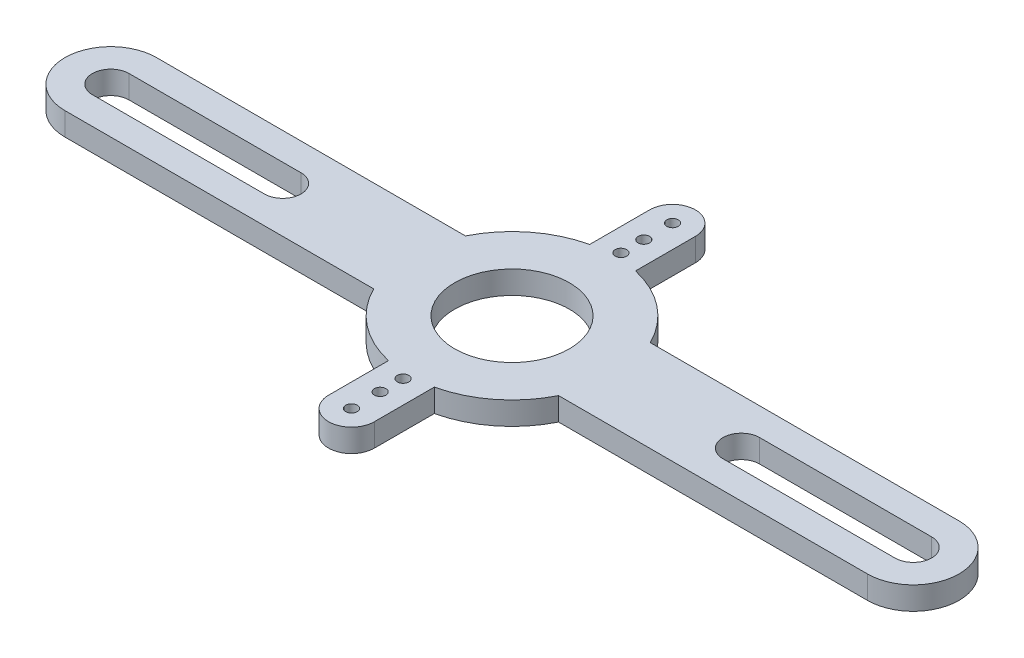
ISO-10303-21;
HEADER;
FILE_DESCRIPTION(('STEP AP214'),'2;1');
FILE_NAME('part.step','',(''),(''),'','','');
FILE_SCHEMA(('AUTOMOTIVE_DESIGN { 1 0 10303 214 1 1 1 1 }'));
ENDSEC;
DATA;
#1=APPLICATION_CONTEXT('core data for automotive mechanical design processes');
#2=APPLICATION_PROTOCOL_DEFINITION('international standard','automotive_design',2000,#1);
#3=PRODUCT_CONTEXT('',#1,'mechanical');
#4=PRODUCT('Part','Part','',(#3));
#5=PRODUCT_RELATED_PRODUCT_CATEGORY('part','',(#4));
#6=PRODUCT_DEFINITION_FORMATION('','',#4);
#7=PRODUCT_DEFINITION_CONTEXT('part definition',#1,'design');
#8=PRODUCT_DEFINITION('design','',#6,#7);
#9=PRODUCT_DEFINITION_SHAPE('','',#8);
#10=(LENGTH_UNIT() NAMED_UNIT(*) SI_UNIT(.MILLI.,.METRE.));
#11=(NAMED_UNIT(*) PLANE_ANGLE_UNIT() SI_UNIT($,.RADIAN.));
#12=(NAMED_UNIT(*) SI_UNIT($,.STERADIAN.) SOLID_ANGLE_UNIT());
#13=UNCERTAINTY_MEASURE_WITH_UNIT(LENGTH_MEASURE(1.E-05),#10,'distance_accuracy_value','');
#14=(GEOMETRIC_REPRESENTATION_CONTEXT(3) GLOBAL_UNCERTAINTY_ASSIGNED_CONTEXT((#13)) GLOBAL_UNIT_ASSIGNED_CONTEXT((#10,
#11,#12)) REPRESENTATION_CONTEXT('',''));
#15=CARTESIAN_POINT('',(0.,0.,0.));
#16=DIRECTION('',(0.,0.,1.));
#17=DIRECTION('',(1.,0.,0.));
#18=AXIS2_PLACEMENT_3D('',#15,#16,#17);
#19=CARTESIAN_POINT('',(33.,-82.4621125123532,0.));
#20=DIRECTION('',(-1.,0.,0.));
#21=DIRECTION('',(0.,0.,1.));
#22=AXIS2_PLACEMENT_3D('',#19,#20,#21);
#23=PLANE('',#22);
#24=DIRECTION('',(0.,1.,0.));
#25=VECTOR('',#24,1.);
#26=CARTESIAN_POINT('',(33.,-25.4558441227157,-8.77496438739212));
#27=LINE('',#26,#25);
#28=CARTESIAN_POINT('',(33.,2.,-8.77496438739212));
#29=VERTEX_POINT('',#28);
#30=CARTESIAN_POINT('',(33.,0.,-8.77496438739212));
#31=VERTEX_POINT('',#30);
#32=EDGE_CURVE('E758',#29,#31,#27,.F.);
#33=ORIENTED_EDGE('',*,*,#32,.F.);
#34=DIRECTION('',(0.,0.,1.));
#35=VECTOR('',#34,1.);
#36=CARTESIAN_POINT('',(33.,2.,0.));
#37=LINE('',#36,#35);
#38=CARTESIAN_POINT('',(33.,2.,-14.));
#39=VERTEX_POINT('',#38);
#40=EDGE_CURVE('E258',#39,#29,#37,.T.);
#41=ORIENTED_EDGE('',*,*,#40,.F.);
#42=DIRECTION('',(0.,1.,0.));
#43=VECTOR('',#42,1.);
#44=CARTESIAN_POINT('',(33.,-82.4621125123532,-14.));
#45=LINE('',#44,#43);
#46=CARTESIAN_POINT('',(33.,0.,-14.));
#47=VERTEX_POINT('',#46);
#48=EDGE_CURVE('E317',#47,#39,#45,.T.);
#49=ORIENTED_EDGE('',*,*,#48,.F.);
#50=DIRECTION('',(0.,0.,-1.));
#51=VECTOR('',#50,1.);
#52=CARTESIAN_POINT('',(33.,0.,0.));
#53=LINE('',#52,#51);
#54=EDGE_CURVE('E348',#31,#47,#53,.T.);
#55=ORIENTED_EDGE('',*,*,#54,.F.);
#56=EDGE_LOOP('',(#33,#41,#49,#55));
#57=FACE_BOUND('',#56,.T.);
#58=ADVANCED_FACE('F40',(#57),#23,.T.);
#59=CARTESIAN_POINT('',(37.,-82.4621125123532,0.));
#60=DIRECTION('',(-1.,0.,0.));
#61=DIRECTION('',(0.,0.,1.));
#62=AXIS2_PLACEMENT_3D('',#59,#60,#61);
#63=PLANE('',#62);
#64=DIRECTION('',(0.,0.,1.));
#65=VECTOR('',#64,1.);
#66=CARTESIAN_POINT('',(37.,2.,0.));
#67=LINE('',#66,#65);
#68=CARTESIAN_POINT('',(37.,2.,-14.));
#69=VERTEX_POINT('',#68);
#70=CARTESIAN_POINT('',(37.,2.,-8.77496438739212));
#71=VERTEX_POINT('',#70);
#72=EDGE_CURVE('E55',#69,#71,#67,.T.);
#73=ORIENTED_EDGE('',*,*,#72,.T.);
#74=DIRECTION('',(0.,1.,0.));
#75=VECTOR('',#74,1.);
#76=CARTESIAN_POINT('',(37.,-25.4558441227157,-8.77496438739212));
#77=LINE('',#76,#75);
#78=CARTESIAN_POINT('',(37.,0.,-8.77496438739212));
#79=VERTEX_POINT('',#78);
#80=EDGE_CURVE('E765',#71,#79,#77,.F.);
#81=ORIENTED_EDGE('',*,*,#80,.T.);
#82=DIRECTION('',(0.,0.,-1.));
#83=VECTOR('',#82,1.);
#84=CARTESIAN_POINT('',(37.,0.,0.));
#85=LINE('',#84,#83);
#86=CARTESIAN_POINT('',(37.,0.,-14.));
#87=VERTEX_POINT('',#86);
#88=EDGE_CURVE('E301',#79,#87,#85,.T.);
#89=ORIENTED_EDGE('',*,*,#88,.T.);
#90=DIRECTION('',(0.,1.,0.));
#91=VECTOR('',#90,1.);
#92=CARTESIAN_POINT('',(37.,-82.4621125123532,-14.));
#93=LINE('',#92,#91);
#94=EDGE_CURVE('E322',#87,#69,#93,.T.);
#95=ORIENTED_EDGE('',*,*,#94,.T.);
#96=EDGE_LOOP('',(#73,#81,#89,#95));
#97=FACE_BOUND('',#96,.T.);
#98=ADVANCED_FACE('F441',(#97),#63,.F.);
#99=CARTESIAN_POINT('',(37.,-82.4621125123532,0.));
#100=DIRECTION('',(1.,0.,0.));
#101=DIRECTION('',(0.,0.,-1.));
#102=AXIS2_PLACEMENT_3D('',#99,#100,#101);
#103=PLANE('',#102);
#104=DIRECTION('',(0.,1.,0.));
#105=VECTOR('',#104,1.);
#106=CARTESIAN_POINT('',(37.,-25.4558441227157,8.77496438739212));
#107=LINE('',#106,#105);
#108=CARTESIAN_POINT('',(37.,2.,8.77496438739212));
#109=VERTEX_POINT('',#108);
#110=CARTESIAN_POINT('',(37.,0.,8.77496438739212));
#111=VERTEX_POINT('',#110);
#112=EDGE_CURVE('E217',#109,#111,#107,.F.);
#113=ORIENTED_EDGE('',*,*,#112,.F.);
#114=DIRECTION('',(0.,0.,-1.));
#115=VECTOR('',#114,1.);
#116=CARTESIAN_POINT('',(37.,2.,0.));
#117=LINE('',#116,#115);
#118=CARTESIAN_POINT('',(37.,2.,14.));
#119=VERTEX_POINT('',#118);
#120=EDGE_CURVE('E311',#119,#109,#117,.T.);
#121=ORIENTED_EDGE('',*,*,#120,.F.);
#122=DIRECTION('',(0.,1.,0.));
#123=VECTOR('',#122,1.);
#124=CARTESIAN_POINT('',(37.,-82.4621125123532,14.));
#125=LINE('',#124,#123);
#126=CARTESIAN_POINT('',(37.,0.,14.));
#127=VERTEX_POINT('',#126);
#128=EDGE_CURVE('E315',#127,#119,#125,.T.);
#129=ORIENTED_EDGE('',*,*,#128,.F.);
#130=DIRECTION('',(0.,0.,1.));
#131=VECTOR('',#130,1.);
#132=CARTESIAN_POINT('',(37.,0.,0.));
#133=LINE('',#132,#131);
#134=EDGE_CURVE('E346',#111,#127,#133,.T.);
#135=ORIENTED_EDGE('',*,*,#134,.F.);
#136=EDGE_LOOP('',(#113,#121,#129,#135));
#137=FACE_BOUND('',#136,.T.);
#138=ADVANCED_FACE('F447',(#137),#103,.T.);
#139=CARTESIAN_POINT('',(33.,-82.4621125123532,0.));
#140=DIRECTION('',(1.,0.,0.));
#141=DIRECTION('',(0.,0.,-1.));
#142=AXIS2_PLACEMENT_3D('',#139,#140,#141);
#143=PLANE('',#142);
#144=DIRECTION('',(0.,0.,-1.));
#145=VECTOR('',#144,1.);
#146=CARTESIAN_POINT('',(33.,2.,0.));
#147=LINE('',#146,#145);
#148=CARTESIAN_POINT('',(33.,2.,14.));
#149=VERTEX_POINT('',#148);
#150=CARTESIAN_POINT('',(33.,2.,8.77496438739212));
#151=VERTEX_POINT('',#150);
#152=EDGE_CURVE('E63',#149,#151,#147,.T.);
#153=ORIENTED_EDGE('',*,*,#152,.T.);
#154=DIRECTION('',(0.,1.,0.));
#155=VECTOR('',#154,1.);
#156=CARTESIAN_POINT('',(33.,-25.4558441227157,8.77496438739212));
#157=LINE('',#156,#155);
#158=CARTESIAN_POINT('',(33.,0.,8.77496438739212));
#159=VERTEX_POINT('',#158);
#160=EDGE_CURVE('E212',#151,#159,#157,.F.);
#161=ORIENTED_EDGE('',*,*,#160,.T.);
#162=DIRECTION('',(0.,0.,1.));
#163=VECTOR('',#162,1.);
#164=CARTESIAN_POINT('',(33.,0.,0.));
#165=LINE('',#164,#163);
#166=CARTESIAN_POINT('',(33.,0.,14.));
#167=VERTEX_POINT('',#166);
#168=EDGE_CURVE('E202',#159,#167,#165,.T.);
#169=ORIENTED_EDGE('',*,*,#168,.T.);
#170=DIRECTION('',(0.,1.,0.));
#171=VECTOR('',#170,1.);
#172=CARTESIAN_POINT('',(33.,-82.4621125123532,14.));
#173=LINE('',#172,#171);
#174=EDGE_CURVE('E209',#167,#149,#173,.T.);
#175=ORIENTED_EDGE('',*,*,#174,.T.);
#176=EDGE_LOOP('',(#153,#161,#169,#175));
#177=FACE_BOUND('',#176,.T.);
#178=ADVANCED_FACE('F213',(#177),#143,.F.);
#179=CARTESIAN_POINT('',(0.,2.,0.));
#180=DIRECTION('',(0.,1.,0.));
#181=DIRECTION('',(0.,0.,1.));
#182=AXIS2_PLACEMENT_3D('',#179,#180,#181);
#183=PLANE('',#182);
#184=CARTESIAN_POINT('',(35.,2.,0.));
#185=DIRECTION('',(0.,1.,0.));
#186=DIRECTION('',(0.,0.,1.));
#187=AXIS2_PLACEMENT_3D('',#184,#185,#186);
#188=CIRCLE('',#187,5.);
#189=CARTESIAN_POINT('',(35.,2.,5.));
#190=VERTEX_POINT('',#189);
#191=EDGE_CURVE('E244',#190,#190,#188,.T.);
#192=ORIENTED_EDGE('',*,*,#191,.F.);
#193=EDGE_LOOP('',(#192));
#194=FACE_BOUND('',#193,.T.);
#195=ORIENTED_EDGE('',*,*,#40,.T.);
#196=CARTESIAN_POINT('',(35.,2.,0.));
#197=DIRECTION('',(0.,1.,0.));
#198=DIRECTION('',(0.,0.,1.));
#199=AXIS2_PLACEMENT_3D('',#196,#197,#198);
#200=CIRCLE('',#199,9.);
#201=CARTESIAN_POINT('',(26.9377422517015,2.,-4.));
#202=VERTEX_POINT('',#201);
#203=EDGE_CURVE('E243',#29,#202,#200,.T.);
#204=ORIENTED_EDGE('',*,*,#203,.T.);
#205=DIRECTION('',(1.,0.,0.));
#206=VECTOR('',#205,1.);
#207=CARTESIAN_POINT('',(0.,2.,-4.));
#208=LINE('',#207,#206);
#209=CARTESIAN_POINT('',(0.,2.,-4.));
#210=VERTEX_POINT('',#209);
#211=EDGE_CURVE('E776',#210,#202,#208,.T.);
#212=ORIENTED_EDGE('',*,*,#211,.F.);
#213=CARTESIAN_POINT('',(0.,2.,0.));
#214=DIRECTION('',(0.,1.,0.));
#215=DIRECTION('',(0.,0.,1.));
#216=AXIS2_PLACEMENT_3D('',#213,#214,#215);
#217=CIRCLE('',#216,4.);
#218=CARTESIAN_POINT('',(0.,2.,4.));
#219=VERTEX_POINT('',#218);
#220=EDGE_CURVE('E771',#210,#219,#217,.T.);
#221=ORIENTED_EDGE('',*,*,#220,.T.);
#222=DIRECTION('',(-1.,0.,0.));
#223=VECTOR('',#222,1.);
#224=CARTESIAN_POINT('',(0.,2.,4.));
#225=LINE('',#224,#223);
#226=CARTESIAN_POINT('',(26.9377422517015,2.,4.));
#227=VERTEX_POINT('',#226);
#228=EDGE_CURVE('E786',#227,#219,#225,.T.);
#229=ORIENTED_EDGE('',*,*,#228,.F.);
#230=EDGE_CURVE('E238',#227,#151,#200,.T.);
#231=ORIENTED_EDGE('',*,*,#230,.T.);
#232=ORIENTED_EDGE('',*,*,#152,.F.);
#233=CARTESIAN_POINT('',(35.,2.,14.));
#234=DIRECTION('',(0.,1.,0.));
#235=DIRECTION('',(0.,0.,1.));
#236=AXIS2_PLACEMENT_3D('',#233,#234,#235);
#237=CIRCLE('',#236,2.);
#238=EDGE_CURVE('E210',#119,#149,#237,.F.);
#239=ORIENTED_EDGE('',*,*,#238,.F.);
#240=ORIENTED_EDGE('',*,*,#120,.T.);
#241=CARTESIAN_POINT('',(43.0622577482986,2.,4.));
#242=VERTEX_POINT('',#241);
#243=EDGE_CURVE('E231',#109,#242,#200,.T.);
#244=ORIENTED_EDGE('',*,*,#243,.T.);
#245=CARTESIAN_POINT('',(70.,2.,4.00000000000001));
#246=VERTEX_POINT('',#245);
#247=EDGE_CURVE('E783',#246,#242,#225,.T.);
#248=ORIENTED_EDGE('',*,*,#247,.F.);
#249=CARTESIAN_POINT('',(70.,2.,0.));
#250=DIRECTION('',(0.,1.,0.));
#251=DIRECTION('',(0.,0.,1.));
#252=AXIS2_PLACEMENT_3D('',#249,#250,#251);
#253=CIRCLE('',#252,4.00000000000001);
#254=CARTESIAN_POINT('',(70.,2.,-4.00000000000001));
#255=VERTEX_POINT('',#254);
#256=EDGE_CURVE('E775',#246,#255,#253,.T.);
#257=ORIENTED_EDGE('',*,*,#256,.T.);
#258=DIRECTION('',(1.,0.,0.));
#259=VECTOR('',#258,1.);
#260=CARTESIAN_POINT('',(0.,2.,-4.));
#261=LINE('',#260,#259);
#262=CARTESIAN_POINT('',(43.0622577482986,2.,-4.));
#263=VERTEX_POINT('',#262);
#264=EDGE_CURVE('E762',#263,#255,#261,.T.);
#265=ORIENTED_EDGE('',*,*,#264,.F.);
#266=EDGE_CURVE('E236',#263,#71,#200,.T.);
#267=ORIENTED_EDGE('',*,*,#266,.T.);
#268=ORIENTED_EDGE('',*,*,#72,.F.);
#269=CARTESIAN_POINT('',(35.,2.,-14.));
#270=DIRECTION('',(0.,1.,0.));
#271=DIRECTION('',(0.,0.,1.));
#272=AXIS2_PLACEMENT_3D('',#269,#270,#271);
#273=CIRCLE('',#272,2.);
#274=EDGE_CURVE('E319',#69,#39,#273,.T.);
#275=ORIENTED_EDGE('',*,*,#274,.T.);
#276=EDGE_LOOP('',(#195,#204,#212,#221,#229,#231,#232,#239,#240,#244,#248,#257,#265,#267,#268,#275));
#277=FACE_BOUND('',#276,.T.);
#278=CARTESIAN_POINT('',(35.,2.,-9.5));
#279=DIRECTION('',(0.,1.,0.));
#280=DIRECTION('',(0.,0.,1.));
#281=AXIS2_PLACEMENT_3D('',#278,#279,#280);
#282=CIRCLE('',#281,0.499999999999999);
#283=CARTESIAN_POINT('',(35.,2.,-9.));
#284=VERTEX_POINT('',#283);
#285=EDGE_CURVE('E262',#284,#284,#282,.T.);
#286=ORIENTED_EDGE('',*,*,#285,.F.);
#287=EDGE_LOOP('',(#286));
#288=FACE_BOUND('',#287,.T.);
#289=CARTESIAN_POINT('',(35.,2.,9.5));
#290=DIRECTION('',(0.,1.,0.));
#291=DIRECTION('',(0.,0.,1.));
#292=AXIS2_PLACEMENT_3D('',#289,#290,#291);
#293=CIRCLE('',#292,0.499999999999999);
#294=CARTESIAN_POINT('',(35.,2.,10.));
#295=VERTEX_POINT('',#294);
#296=EDGE_CURVE('E266',#295,#295,#293,.F.);
#297=ORIENTED_EDGE('',*,*,#296,.T.);
#298=EDGE_LOOP('',(#297));
#299=FACE_BOUND('',#298,.T.);
#300=CARTESIAN_POINT('',(35.,2.,11.5));
#301=DIRECTION('',(0.,1.,0.));
#302=DIRECTION('',(0.,0.,1.));
#303=AXIS2_PLACEMENT_3D('',#300,#301,#302);
#304=CIRCLE('',#303,0.499999999999999);
#305=CARTESIAN_POINT('',(35.,2.,12.));
#306=VERTEX_POINT('',#305);
#307=EDGE_CURVE('E270',#306,#306,#304,.F.);
#308=ORIENTED_EDGE('',*,*,#307,.T.);
#309=EDGE_LOOP('',(#308));
#310=FACE_BOUND('',#309,.T.);
#311=CARTESIAN_POINT('',(35.,2.,14.));
#312=DIRECTION('',(0.,1.,0.));
#313=DIRECTION('',(0.,0.,1.));
#314=AXIS2_PLACEMENT_3D('',#311,#312,#313);
#315=CIRCLE('',#314,0.499999999999999);
#316=CARTESIAN_POINT('',(35.,2.,14.5));
#317=VERTEX_POINT('',#316);
#318=EDGE_CURVE('E274',#317,#317,#315,.F.);
#319=ORIENTED_EDGE('',*,*,#318,.T.);
#320=EDGE_LOOP('',(#319));
#321=FACE_BOUND('',#320,.T.);
#322=DIRECTION('',(1.,0.,0.));
#323=VECTOR('',#322,1.);
#324=CARTESIAN_POINT('',(0.,2.,-1.6));
#325=LINE('',#324,#323);
#326=CARTESIAN_POINT('',(0.,2.,-1.6));
#327=VERTEX_POINT('',#326);
#328=CARTESIAN_POINT('',(15.,2.,-1.6));
#329=VERTEX_POINT('',#328);
#330=EDGE_CURVE('E279',#327,#329,#325,.T.);
#331=ORIENTED_EDGE('',*,*,#330,.T.);
#332=CARTESIAN_POINT('',(15.,2.,0.));
#333=DIRECTION('',(0.,1.,0.));
#334=DIRECTION('',(0.,0.,1.));
#335=AXIS2_PLACEMENT_3D('',#332,#333,#334);
#336=CIRCLE('',#335,1.6);
#337=CARTESIAN_POINT('',(15.,2.,1.6));
#338=VERTEX_POINT('',#337);
#339=EDGE_CURVE('E413',#329,#338,#336,.F.);
#340=ORIENTED_EDGE('',*,*,#339,.T.);
#341=DIRECTION('',(-1.,0.,0.));
#342=VECTOR('',#341,1.);
#343=CARTESIAN_POINT('',(0.,2.,1.6));
#344=LINE('',#343,#342);
#345=CARTESIAN_POINT('',(0.,2.,1.6));
#346=VERTEX_POINT('',#345);
#347=EDGE_CURVE('E396',#338,#346,#344,.T.);
#348=ORIENTED_EDGE('',*,*,#347,.T.);
#349=CARTESIAN_POINT('',(0.,2.,0.));
#350=DIRECTION('',(0.,1.,0.));
#351=DIRECTION('',(0.,0.,1.));
#352=AXIS2_PLACEMENT_3D('',#349,#350,#351);
#353=CIRCLE('',#352,1.6);
#354=EDGE_CURVE('E410',#346,#327,#353,.F.);
#355=ORIENTED_EDGE('',*,*,#354,.T.);
#356=EDGE_LOOP('',(#331,#340,#348,#355));
#357=FACE_BOUND('',#356,.T.);
#358=CARTESIAN_POINT('',(35.,2.,-11.5));
#359=DIRECTION('',(0.,1.,0.));
#360=DIRECTION('',(0.,0.,1.));
#361=AXIS2_PLACEMENT_3D('',#358,#359,#360);
#362=CIRCLE('',#361,0.499999999999999);
#363=CARTESIAN_POINT('',(35.,2.,-11.));
#364=VERTEX_POINT('',#363);
#365=EDGE_CURVE('E283',#364,#364,#362,.T.);
#366=ORIENTED_EDGE('',*,*,#365,.F.);
#367=EDGE_LOOP('',(#366));
#368=FACE_BOUND('',#367,.T.);
#369=CARTESIAN_POINT('',(35.,2.,-14.));
#370=DIRECTION('',(0.,1.,0.));
#371=DIRECTION('',(0.,0.,1.));
#372=AXIS2_PLACEMENT_3D('',#369,#370,#371);
#373=CIRCLE('',#372,0.499999999999999);
#374=CARTESIAN_POINT('',(35.,2.,-13.5));
#375=VERTEX_POINT('',#374);
#376=EDGE_CURVE('E287',#375,#375,#373,.T.);
#377=ORIENTED_EDGE('',*,*,#376,.F.);
#378=EDGE_LOOP('',(#377));
#379=FACE_BOUND('',#378,.T.);
#380=DIRECTION('',(-1.,0.,0.));
#381=VECTOR('',#380,1.);
#382=CARTESIAN_POINT('',(0.,2.,1.59999999999998));
#383=LINE('',#382,#381);
#384=CARTESIAN_POINT('',(70.,2.,1.60000000000001));
#385=VERTEX_POINT('',#384);
#386=CARTESIAN_POINT('',(55.,2.,1.6));
#387=VERTEX_POINT('',#386);
#388=EDGE_CURVE('E291',#385,#387,#383,.T.);
#389=ORIENTED_EDGE('',*,*,#388,.T.);
#390=CARTESIAN_POINT('',(55.,2.,0.));
#391=DIRECTION('',(0.,1.,0.));
#392=DIRECTION('',(0.,0.,1.));
#393=AXIS2_PLACEMENT_3D('',#390,#391,#392);
#394=CIRCLE('',#393,1.6);
#395=CARTESIAN_POINT('',(55.,2.,-1.6));
#396=VERTEX_POINT('',#395);
#397=EDGE_CURVE('E293',#387,#396,#394,.F.);
#398=ORIENTED_EDGE('',*,*,#397,.T.);
#399=DIRECTION('',(1.,0.,0.));
#400=VECTOR('',#399,1.);
#401=CARTESIAN_POINT('',(0.,2.,-1.59999999999996));
#402=LINE('',#401,#400);
#403=CARTESIAN_POINT('',(70.,2.,-1.60000000000001));
#404=VERTEX_POINT('',#403);
#405=EDGE_CURVE('E303',#396,#404,#402,.T.);
#406=ORIENTED_EDGE('',*,*,#405,.T.);
#407=CARTESIAN_POINT('',(70.,2.,0.));
#408=DIRECTION('',(0.,1.,0.));
#409=DIRECTION('',(0.,0.,1.));
#410=AXIS2_PLACEMENT_3D('',#407,#408,#409);
#411=CIRCLE('',#410,1.60000000000001);
#412=EDGE_CURVE('E295',#404,#385,#411,.F.);
#413=ORIENTED_EDGE('',*,*,#412,.T.);
#414=EDGE_LOOP('',(#389,#398,#406,#413));
#415=FACE_BOUND('',#414,.T.);
#416=ADVANCED_FACE('F252',(#194,#277,#288,#299,#310,#321,#357,#368,#379,#415),#183,.T.);
#417=CARTESIAN_POINT('',(0.,0.,0.));
#418=DIRECTION('',(0.,1.,0.));
#419=DIRECTION('',(0.,0.,1.));
#420=AXIS2_PLACEMENT_3D('',#417,#418,#419);
#421=PLANE('',#420);
#422=CARTESIAN_POINT('',(35.,0.,0.));
#423=DIRECTION('',(0.,1.,0.));
#424=DIRECTION('',(0.,0.,1.));
#425=AXIS2_PLACEMENT_3D('',#422,#423,#424);
#426=CIRCLE('',#425,9.);
#427=CARTESIAN_POINT('',(26.9377422517015,0.,-4.));
#428=VERTEX_POINT('',#427);
#429=EDGE_CURVE('E223',#428,#31,#426,.F.);
#430=ORIENTED_EDGE('',*,*,#429,.T.);
#431=ORIENTED_EDGE('',*,*,#54,.T.);
#432=CARTESIAN_POINT('',(35.,0.,-14.));
#433=DIRECTION('',(0.,1.,0.));
#434=DIRECTION('',(0.,0.,1.));
#435=AXIS2_PLACEMENT_3D('',#432,#433,#434);
#436=CIRCLE('',#435,2.);
#437=EDGE_CURVE('E351',#47,#87,#436,.F.);
#438=ORIENTED_EDGE('',*,*,#437,.T.);
#439=ORIENTED_EDGE('',*,*,#88,.F.);
#440=CARTESIAN_POINT('',(43.0622577482986,0.,-4.));
#441=VERTEX_POINT('',#440);
#442=EDGE_CURVE('E229',#79,#441,#426,.F.);
#443=ORIENTED_EDGE('',*,*,#442,.T.);
#444=DIRECTION('',(-1.,0.,0.));
#445=VECTOR('',#444,1.);
#446=CARTESIAN_POINT('',(0.,0.,-4.));
#447=LINE('',#446,#445);
#448=CARTESIAN_POINT('',(70.,0.,-4.00000000000001));
#449=VERTEX_POINT('',#448);
#450=EDGE_CURVE('E778',#449,#441,#447,.T.);
#451=ORIENTED_EDGE('',*,*,#450,.F.);
#452=CARTESIAN_POINT('',(70.,0.,0.));
#453=DIRECTION('',(0.,1.,0.));
#454=DIRECTION('',(0.,0.,1.));
#455=AXIS2_PLACEMENT_3D('',#452,#453,#454);
#456=CIRCLE('',#455,4.00000000000001);
#457=CARTESIAN_POINT('',(70.,0.,4.00000000000001));
#458=VERTEX_POINT('',#457);
#459=EDGE_CURVE('E400',#449,#458,#456,.F.);
#460=ORIENTED_EDGE('',*,*,#459,.T.);
#461=DIRECTION('',(1.,0.,0.));
#462=VECTOR('',#461,1.);
#463=CARTESIAN_POINT('',(0.,0.,4.));
#464=LINE('',#463,#462);
#465=CARTESIAN_POINT('',(43.0622577482986,0.,4.));
#466=VERTEX_POINT('',#465);
#467=EDGE_CURVE('E767',#466,#458,#464,.T.);
#468=ORIENTED_EDGE('',*,*,#467,.F.);
#469=EDGE_CURVE('E225',#466,#111,#426,.F.);
#470=ORIENTED_EDGE('',*,*,#469,.T.);
#471=ORIENTED_EDGE('',*,*,#134,.T.);
#472=CARTESIAN_POINT('',(35.,0.,14.));
#473=DIRECTION('',(0.,1.,0.));
#474=DIRECTION('',(0.,0.,1.));
#475=AXIS2_PLACEMENT_3D('',#472,#473,#474);
#476=CIRCLE('',#475,2.);
#477=EDGE_CURVE('E207',#167,#127,#476,.T.);
#478=ORIENTED_EDGE('',*,*,#477,.F.);
#479=ORIENTED_EDGE('',*,*,#168,.F.);
#480=CARTESIAN_POINT('',(26.9377422517015,0.,4.));
#481=VERTEX_POINT('',#480);
#482=EDGE_CURVE('E205',#159,#481,#426,.F.);
#483=ORIENTED_EDGE('',*,*,#482,.T.);
#484=CARTESIAN_POINT('',(0.,0.,4.));
#485=VERTEX_POINT('',#484);
#486=EDGE_CURVE('E795',#485,#481,#464,.T.);
#487=ORIENTED_EDGE('',*,*,#486,.F.);
#488=CARTESIAN_POINT('',(0.,0.,0.));
#489=DIRECTION('',(0.,1.,0.));
#490=DIRECTION('',(0.,0.,1.));
#491=AXIS2_PLACEMENT_3D('',#488,#489,#490);
#492=CIRCLE('',#491,4.);
#493=CARTESIAN_POINT('',(0.,0.,-4.));
#494=VERTEX_POINT('',#493);
#495=EDGE_CURVE('E774',#485,#494,#492,.F.);
#496=ORIENTED_EDGE('',*,*,#495,.T.);
#497=DIRECTION('',(-1.,0.,0.));
#498=VECTOR('',#497,1.);
#499=CARTESIAN_POINT('',(0.,0.,-4.));
#500=LINE('',#499,#498);
#501=EDGE_CURVE('E789',#428,#494,#500,.T.);
#502=ORIENTED_EDGE('',*,*,#501,.F.);
#503=EDGE_LOOP('',(#430,#431,#438,#439,#443,#451,#460,#468,#470,#471,#478,#479,#483,#487,#496,#502));
#504=FACE_BOUND('',#503,.T.);
#505=CARTESIAN_POINT('',(35.,0.,0.));
#506=DIRECTION('',(0.,1.,0.));
#507=DIRECTION('',(0.,0.,1.));
#508=AXIS2_PLACEMENT_3D('',#505,#506,#507);
#509=CIRCLE('',#508,5.);
#510=CARTESIAN_POINT('',(35.,0.,5.));
#511=VERTEX_POINT('',#510);
#512=EDGE_CURVE('E222',#511,#511,#509,.F.);
#513=ORIENTED_EDGE('',*,*,#512,.F.);
#514=EDGE_LOOP('',(#513));
#515=FACE_BOUND('',#514,.T.);
#516=CARTESIAN_POINT('',(35.,0.,-9.5));
#517=DIRECTION('',(0.,1.,0.));
#518=DIRECTION('',(0.,0.,1.));
#519=AXIS2_PLACEMENT_3D('',#516,#517,#518);
#520=CIRCLE('',#519,0.499999999999999);
#521=CARTESIAN_POINT('',(35.,0.,-9.));
#522=VERTEX_POINT('',#521);
#523=EDGE_CURVE('E325',#522,#522,#520,.F.);
#524=ORIENTED_EDGE('',*,*,#523,.F.);
#525=EDGE_LOOP('',(#524));
#526=FACE_BOUND('',#525,.T.);
#527=CARTESIAN_POINT('',(35.,0.,9.5));
#528=DIRECTION('',(0.,1.,0.));
#529=DIRECTION('',(0.,0.,1.));
#530=AXIS2_PLACEMENT_3D('',#527,#528,#529);
#531=CIRCLE('',#530,0.499999999999999);
#532=CARTESIAN_POINT('',(35.,0.,10.));
#533=VERTEX_POINT('',#532);
#534=EDGE_CURVE('E344',#533,#533,#531,.T.);
#535=ORIENTED_EDGE('',*,*,#534,.T.);
#536=EDGE_LOOP('',(#535));
#537=FACE_BOUND('',#536,.T.);
#538=CARTESIAN_POINT('',(35.,0.,11.5));
#539=DIRECTION('',(0.,1.,0.));
#540=DIRECTION('',(0.,0.,1.));
#541=AXIS2_PLACEMENT_3D('',#538,#539,#540);
#542=CIRCLE('',#541,0.499999999999999);
#543=CARTESIAN_POINT('',(35.,0.,12.));
#544=VERTEX_POINT('',#543);
#545=EDGE_CURVE('E308',#544,#544,#542,.T.);
#546=ORIENTED_EDGE('',*,*,#545,.T.);
#547=EDGE_LOOP('',(#546));
#548=FACE_BOUND('',#547,.T.);
#549=CARTESIAN_POINT('',(35.,0.,14.));
#550=DIRECTION('',(0.,1.,0.));
#551=DIRECTION('',(0.,0.,1.));
#552=AXIS2_PLACEMENT_3D('',#549,#550,#551);
#553=CIRCLE('',#552,0.499999999999999);
#554=CARTESIAN_POINT('',(35.,0.,14.5));
#555=VERTEX_POINT('',#554);
#556=EDGE_CURVE('E341',#555,#555,#553,.T.);
#557=ORIENTED_EDGE('',*,*,#556,.T.);
#558=EDGE_LOOP('',(#557));
#559=FACE_BOUND('',#558,.T.);
#560=CARTESIAN_POINT('',(15.,0.,0.));
#561=DIRECTION('',(0.,1.,0.));
#562=DIRECTION('',(0.,0.,1.));
#563=AXIS2_PLACEMENT_3D('',#560,#561,#562);
#564=CIRCLE('',#563,1.6);
#565=CARTESIAN_POINT('',(15.,0.,-1.6));
#566=VERTEX_POINT('',#565);
#567=CARTESIAN_POINT('',(15.,0.,1.6));
#568=VERTEX_POINT('',#567);
#569=EDGE_CURVE('E362',#566,#568,#564,.F.);
#570=ORIENTED_EDGE('',*,*,#569,.F.);
#571=DIRECTION('',(1.,0.,0.));
#572=VECTOR('',#571,1.);
#573=CARTESIAN_POINT('',(0.,0.,-1.6));
#574=LINE('',#573,#572);
#575=CARTESIAN_POINT('',(0.,0.,-1.6));
#576=VERTEX_POINT('',#575);
#577=EDGE_CURVE('E360',#576,#566,#574,.T.);
#578=ORIENTED_EDGE('',*,*,#577,.F.);
#579=CARTESIAN_POINT('',(0.,0.,0.));
#580=DIRECTION('',(0.,1.,0.));
#581=DIRECTION('',(0.,0.,1.));
#582=AXIS2_PLACEMENT_3D('',#579,#580,#581);
#583=CIRCLE('',#582,1.6);
#584=CARTESIAN_POINT('',(0.,0.,1.6));
#585=VERTEX_POINT('',#584);
#586=EDGE_CURVE('E358',#585,#576,#583,.F.);
#587=ORIENTED_EDGE('',*,*,#586,.F.);
#588=DIRECTION('',(-1.,0.,0.));
#589=VECTOR('',#588,1.);
#590=CARTESIAN_POINT('',(0.,0.,1.6));
#591=LINE('',#590,#589);
#592=EDGE_CURVE('E354',#568,#585,#591,.T.);
#593=ORIENTED_EDGE('',*,*,#592,.F.);
#594=EDGE_LOOP('',(#570,#578,#587,#593));
#595=FACE_BOUND('',#594,.T.);
#596=CARTESIAN_POINT('',(35.,0.,-11.5));
#597=DIRECTION('',(0.,1.,0.));
#598=DIRECTION('',(0.,0.,1.));
#599=AXIS2_PLACEMENT_3D('',#596,#597,#598);
#600=CIRCLE('',#599,0.499999999999999);
#601=CARTESIAN_POINT('',(35.,0.,-11.));
#602=VERTEX_POINT('',#601);
#603=EDGE_CURVE('E327',#602,#602,#600,.F.);
#604=ORIENTED_EDGE('',*,*,#603,.F.);
#605=EDGE_LOOP('',(#604));
#606=FACE_BOUND('',#605,.T.);
#607=CARTESIAN_POINT('',(35.,0.,-14.));
#608=DIRECTION('',(0.,1.,0.));
#609=DIRECTION('',(0.,0.,1.));
#610=AXIS2_PLACEMENT_3D('',#607,#608,#609);
#611=CIRCLE('',#610,0.499999999999999);
#612=CARTESIAN_POINT('',(35.,0.,-13.5));
#613=VERTEX_POINT('',#612);
#614=EDGE_CURVE('E324',#613,#613,#611,.F.);
#615=ORIENTED_EDGE('',*,*,#614,.F.);
#616=EDGE_LOOP('',(#615));
#617=FACE_BOUND('',#616,.T.);
#618=CARTESIAN_POINT('',(55.,0.,0.));
#619=DIRECTION('',(0.,1.,0.));
#620=DIRECTION('',(0.,0.,1.));
#621=AXIS2_PLACEMENT_3D('',#618,#619,#620);
#622=CIRCLE('',#621,1.6);
#623=CARTESIAN_POINT('',(55.,0.,1.6));
#624=VERTEX_POINT('',#623);
#625=CARTESIAN_POINT('',(55.,0.,-1.6));
#626=VERTEX_POINT('',#625);
#627=EDGE_CURVE('E48',#624,#626,#622,.F.);
#628=ORIENTED_EDGE('',*,*,#627,.F.);
#629=DIRECTION('',(-1.,0.,0.));
#630=VECTOR('',#629,1.);
#631=CARTESIAN_POINT('',(0.,0.,1.59999999999998));
#632=LINE('',#631,#630);
#633=CARTESIAN_POINT('',(70.,0.,1.60000000000001));
#634=VERTEX_POINT('',#633);
#635=EDGE_CURVE('E369',#634,#624,#632,.T.);
#636=ORIENTED_EDGE('',*,*,#635,.F.);
#637=CARTESIAN_POINT('',(70.,0.,0.));
#638=DIRECTION('',(0.,1.,0.));
#639=DIRECTION('',(0.,0.,1.));
#640=AXIS2_PLACEMENT_3D('',#637,#638,#639);
#641=CIRCLE('',#640,1.60000000000001);
#642=CARTESIAN_POINT('',(70.,0.,-1.60000000000001));
#643=VERTEX_POINT('',#642);
#644=EDGE_CURVE('E367',#643,#634,#641,.F.);
#645=ORIENTED_EDGE('',*,*,#644,.F.);
#646=DIRECTION('',(1.,0.,0.));
#647=VECTOR('',#646,1.);
#648=CARTESIAN_POINT('',(0.,0.,-1.59999999999996));
#649=LINE('',#648,#647);
#650=EDGE_CURVE('E365',#626,#643,#649,.T.);
#651=ORIENTED_EDGE('',*,*,#650,.F.);
#652=EDGE_LOOP('',(#628,#636,#645,#651));
#653=FACE_BOUND('',#652,.T.);
#654=ADVANCED_FACE('F42',(#504,#515,#526,#537,#548,#559,#595,#606,#617,#653),#421,.F.);
#655=CARTESIAN_POINT('',(35.,-82.4621125123532,-14.));
#656=DIRECTION('',(0.,1.,0.));
#657=DIRECTION('',(0.,0.,1.));
#658=AXIS2_PLACEMENT_3D('',#655,#656,#657);
#659=CYLINDRICAL_SURFACE('',#658,2.);
#660=ORIENTED_EDGE('',*,*,#437,.F.);
#661=ORIENTED_EDGE('',*,*,#48,.T.);
#662=ORIENTED_EDGE('',*,*,#274,.F.);
#663=ORIENTED_EDGE('',*,*,#94,.F.);
#664=EDGE_LOOP('',(#660,#661,#662,#663));
#665=FACE_BOUND('',#664,.T.);
#666=ADVANCED_FACE('F452',(#665),#659,.T.);
#667=CARTESIAN_POINT('',(35.,-82.4621125123532,-9.5));
#668=DIRECTION('',(0.,1.,0.));
#669=DIRECTION('',(0.,0.,1.));
#670=AXIS2_PLACEMENT_3D('',#667,#668,#669);
#671=CYLINDRICAL_SURFACE('',#670,0.499999999999999);
#672=ORIENTED_EDGE('',*,*,#285,.T.);
#673=EDGE_LOOP('',(#672));
#674=FACE_BOUND('',#673,.T.);
#675=ORIENTED_EDGE('',*,*,#523,.T.);
#676=EDGE_LOOP('',(#675));
#677=FACE_BOUND('',#676,.T.);
#678=ADVANCED_FACE('F465',(#674,#677),#671,.F.);
#679=CARTESIAN_POINT('',(35.,-82.4621125123532,-11.5));
#680=DIRECTION('',(0.,1.,0.));
#681=DIRECTION('',(0.,0.,1.));
#682=AXIS2_PLACEMENT_3D('',#679,#680,#681);
#683=CYLINDRICAL_SURFACE('',#682,0.499999999999999);
#684=ORIENTED_EDGE('',*,*,#603,.T.);
#685=EDGE_LOOP('',(#684));
#686=FACE_BOUND('',#685,.T.);
#687=ORIENTED_EDGE('',*,*,#365,.T.);
#688=EDGE_LOOP('',(#687));
#689=FACE_BOUND('',#688,.T.);
#690=ADVANCED_FACE('F468',(#686,#689),#683,.F.);
#691=CARTESIAN_POINT('',(35.,-82.4621125123532,-14.));
#692=DIRECTION('',(0.,1.,0.));
#693=DIRECTION('',(0.,0.,1.));
#694=AXIS2_PLACEMENT_3D('',#691,#692,#693);
#695=CYLINDRICAL_SURFACE('',#694,0.499999999999999);
#696=ORIENTED_EDGE('',*,*,#614,.T.);
#697=EDGE_LOOP('',(#696));
#698=FACE_BOUND('',#697,.T.);
#699=ORIENTED_EDGE('',*,*,#376,.T.);
#700=EDGE_LOOP('',(#699));
#701=FACE_BOUND('',#700,.T.);
#702=ADVANCED_FACE('F460',(#698,#701),#695,.F.);
#703=CARTESIAN_POINT('',(35.,-82.4621125123532,14.));
#704=DIRECTION('',(0.,1.,0.));
#705=DIRECTION('',(0.,0.,1.));
#706=AXIS2_PLACEMENT_3D('',#703,#704,#705);
#707=CYLINDRICAL_SURFACE('',#706,2.);
#708=ORIENTED_EDGE('',*,*,#174,.F.);
#709=ORIENTED_EDGE('',*,*,#477,.T.);
#710=ORIENTED_EDGE('',*,*,#128,.T.);
#711=ORIENTED_EDGE('',*,*,#238,.T.);
#712=EDGE_LOOP('',(#708,#709,#710,#711));
#713=FACE_BOUND('',#712,.T.);
#714=ADVANCED_FACE('F456',(#713),#707,.T.);
#715=CARTESIAN_POINT('',(35.,-82.4621125123532,11.5));
#716=DIRECTION('',(0.,1.,0.));
#717=DIRECTION('',(0.,0.,1.));
#718=AXIS2_PLACEMENT_3D('',#715,#716,#717);
#719=CYLINDRICAL_SURFACE('',#718,0.499999999999999);
#720=ORIENTED_EDGE('',*,*,#545,.F.);
#721=EDGE_LOOP('',(#720));
#722=FACE_BOUND('',#721,.T.);
#723=ORIENTED_EDGE('',*,*,#307,.F.);
#724=EDGE_LOOP('',(#723));
#725=FACE_BOUND('',#724,.T.);
#726=ADVANCED_FACE('F459',(#722,#725),#719,.F.);
#727=CARTESIAN_POINT('',(35.,-82.4621125123532,14.));
#728=DIRECTION('',(0.,1.,0.));
#729=DIRECTION('',(0.,0.,1.));
#730=AXIS2_PLACEMENT_3D('',#727,#728,#729);
#731=CYLINDRICAL_SURFACE('',#730,0.499999999999999);
#732=ORIENTED_EDGE('',*,*,#556,.F.);
#733=EDGE_LOOP('',(#732));
#734=FACE_BOUND('',#733,.T.);
#735=ORIENTED_EDGE('',*,*,#318,.F.);
#736=EDGE_LOOP('',(#735));
#737=FACE_BOUND('',#736,.T.);
#738=ADVANCED_FACE('F478',(#734,#737),#731,.F.);
#739=CARTESIAN_POINT('',(35.,-82.4621125123532,9.5));
#740=DIRECTION('',(0.,1.,0.));
#741=DIRECTION('',(0.,0.,1.));
#742=AXIS2_PLACEMENT_3D('',#739,#740,#741);
#743=CYLINDRICAL_SURFACE('',#742,0.499999999999999);
#744=ORIENTED_EDGE('',*,*,#296,.F.);
#745=EDGE_LOOP('',(#744));
#746=FACE_BOUND('',#745,.T.);
#747=ORIENTED_EDGE('',*,*,#534,.F.);
#748=EDGE_LOOP('',(#747));
#749=FACE_BOUND('',#748,.T.);
#750=ADVANCED_FACE('F476',(#746,#749),#743,.F.);
#751=CARTESIAN_POINT('',(15.,12.,0.));
#752=DIRECTION('',(0.,-1.,0.));
#753=DIRECTION('',(0.,0.,-1.));
#754=AXIS2_PLACEMENT_3D('',#751,#752,#753);
#755=CYLINDRICAL_SURFACE('',#754,1.6);
#756=DIRECTION('',(0.,-1.,0.));
#757=VECTOR('',#756,1.);
#758=CARTESIAN_POINT('',(15.,12.,-1.6));
#759=LINE('',#758,#757);
#760=EDGE_CURVE('E391',#329,#566,#759,.T.);
#761=ORIENTED_EDGE('',*,*,#760,.T.);
#762=ORIENTED_EDGE('',*,*,#569,.T.);
#763=DIRECTION('',(0.,-1.,0.));
#764=VECTOR('',#763,1.);
#765=CARTESIAN_POINT('',(15.,12.,1.6));
#766=LINE('',#765,#764);
#767=EDGE_CURVE('E397',#338,#568,#766,.T.);
#768=ORIENTED_EDGE('',*,*,#767,.F.);
#769=ORIENTED_EDGE('',*,*,#339,.F.);
#770=EDGE_LOOP('',(#761,#762,#768,#769));
#771=FACE_BOUND('',#770,.T.);
#772=ADVANCED_FACE('F417',(#771),#755,.F.);
#773=CARTESIAN_POINT('',(15.,12.,-1.6));
#774=DIRECTION('',(0.,0.,1.));
#775=DIRECTION('',(1.,0.,0.));
#776=AXIS2_PLACEMENT_3D('',#773,#774,#775);
#777=PLANE('',#776);
#778=DIRECTION('',(0.,-1.,0.));
#779=VECTOR('',#778,1.);
#780=CARTESIAN_POINT('',(0.,12.,-1.6));
#781=LINE('',#780,#779);
#782=EDGE_CURVE('E403',#327,#576,#781,.T.);
#783=ORIENTED_EDGE('',*,*,#782,.T.);
#784=ORIENTED_EDGE('',*,*,#577,.T.);
#785=ORIENTED_EDGE('',*,*,#760,.F.);
#786=ORIENTED_EDGE('',*,*,#330,.F.);
#787=EDGE_LOOP('',(#783,#784,#785,#786));
#788=FACE_BOUND('',#787,.T.);
#789=ADVANCED_FACE('F420',(#788),#777,.T.);
#790=CARTESIAN_POINT('',(0.,12.,0.));
#791=DIRECTION('',(0.,-1.,0.));
#792=DIRECTION('',(0.,0.,-1.));
#793=AXIS2_PLACEMENT_3D('',#790,#791,#792);
#794=CYLINDRICAL_SURFACE('',#793,1.6);
#795=DIRECTION('',(0.,-1.,0.));
#796=VECTOR('',#795,1.);
#797=CARTESIAN_POINT('',(0.,12.,1.6));
#798=LINE('',#797,#796);
#799=EDGE_CURVE('E399',#346,#585,#798,.T.);
#800=ORIENTED_EDGE('',*,*,#799,.T.);
#801=ORIENTED_EDGE('',*,*,#586,.T.);
#802=ORIENTED_EDGE('',*,*,#782,.F.);
#803=ORIENTED_EDGE('',*,*,#354,.F.);
#804=EDGE_LOOP('',(#800,#801,#802,#803));
#805=FACE_BOUND('',#804,.T.);
#806=ADVANCED_FACE('F431',(#805),#794,.F.);
#807=CARTESIAN_POINT('',(0.,12.,1.6));
#808=DIRECTION('',(0.,0.,-1.));
#809=DIRECTION('',(-1.,0.,0.));
#810=AXIS2_PLACEMENT_3D('',#807,#808,#809);
#811=PLANE('',#810);
#812=ORIENTED_EDGE('',*,*,#767,.T.);
#813=ORIENTED_EDGE('',*,*,#592,.T.);
#814=ORIENTED_EDGE('',*,*,#799,.F.);
#815=ORIENTED_EDGE('',*,*,#347,.F.);
#816=EDGE_LOOP('',(#812,#813,#814,#815));
#817=FACE_BOUND('',#816,.T.);
#818=ADVANCED_FACE('F428',(#817),#811,.T.);
#819=CARTESIAN_POINT('',(55.,12.,0.));
#820=DIRECTION('',(0.,-1.,0.));
#821=DIRECTION('',(0.,0.,-1.));
#822=AXIS2_PLACEMENT_3D('',#819,#820,#821);
#823=CYLINDRICAL_SURFACE('',#822,1.6);
#824=DIRECTION('',(0.,-1.,0.));
#825=VECTOR('',#824,1.);
#826=CARTESIAN_POINT('',(55.,12.,1.6));
#827=LINE('',#826,#825);
#828=EDGE_CURVE('E378',#387,#624,#827,.T.);
#829=ORIENTED_EDGE('',*,*,#828,.T.);
#830=ORIENTED_EDGE('',*,*,#627,.T.);
#831=DIRECTION('',(0.,-1.,0.));
#832=VECTOR('',#831,1.);
#833=CARTESIAN_POINT('',(55.,12.,-1.6));
#834=LINE('',#833,#832);
#835=EDGE_CURVE('E377',#396,#626,#834,.T.);
#836=ORIENTED_EDGE('',*,*,#835,.F.);
#837=ORIENTED_EDGE('',*,*,#397,.F.);
#838=EDGE_LOOP('',(#829,#830,#836,#837));
#839=FACE_BOUND('',#838,.T.);
#840=ADVANCED_FACE('F376',(#839),#823,.F.);
#841=CARTESIAN_POINT('',(70.,12.,1.60000000000001));
#842=DIRECTION('',(0.,0.,-1.));
#843=DIRECTION('',(-1.,0.,0.));
#844=AXIS2_PLACEMENT_3D('',#841,#842,#843);
#845=PLANE('',#844);
#846=DIRECTION('',(0.,-1.,0.));
#847=VECTOR('',#846,1.);
#848=CARTESIAN_POINT('',(70.,12.,1.60000000000001));
#849=LINE('',#848,#847);
#850=EDGE_CURVE('E388',#385,#634,#849,.T.);
#851=ORIENTED_EDGE('',*,*,#850,.T.);
#852=ORIENTED_EDGE('',*,*,#635,.T.);
#853=ORIENTED_EDGE('',*,*,#828,.F.);
#854=ORIENTED_EDGE('',*,*,#388,.F.);
#855=EDGE_LOOP('',(#851,#852,#853,#854));
#856=FACE_BOUND('',#855,.T.);
#857=ADVANCED_FACE('F540',(#856),#845,.T.);
#858=CARTESIAN_POINT('',(70.,12.,0.));
#859=DIRECTION('',(0.,-1.,0.));
#860=DIRECTION('',(0.,0.,-1.));
#861=AXIS2_PLACEMENT_3D('',#858,#859,#860);
#862=CYLINDRICAL_SURFACE('',#861,1.60000000000001);
#863=DIRECTION('',(0.,-1.,0.));
#864=VECTOR('',#863,1.);
#865=CARTESIAN_POINT('',(70.,12.,-1.60000000000001));
#866=LINE('',#865,#864);
#867=EDGE_CURVE('E385',#404,#643,#866,.T.);
#868=ORIENTED_EDGE('',*,*,#867,.T.);
#869=ORIENTED_EDGE('',*,*,#644,.T.);
#870=ORIENTED_EDGE('',*,*,#850,.F.);
#871=ORIENTED_EDGE('',*,*,#412,.F.);
#872=EDGE_LOOP('',(#868,#869,#870,#871));
#873=FACE_BOUND('',#872,.T.);
#874=ADVANCED_FACE('F387',(#873),#862,.F.);
#875=CARTESIAN_POINT('',(55.,12.,-1.6));
#876=DIRECTION('',(0.,0.,1.));
#877=DIRECTION('',(1.,0.,0.));
#878=AXIS2_PLACEMENT_3D('',#875,#876,#877);
#879=PLANE('',#878);
#880=ORIENTED_EDGE('',*,*,#835,.T.);
#881=ORIENTED_EDGE('',*,*,#650,.T.);
#882=ORIENTED_EDGE('',*,*,#867,.F.);
#883=ORIENTED_EDGE('',*,*,#405,.F.);
#884=EDGE_LOOP('',(#880,#881,#882,#883));
#885=FACE_BOUND('',#884,.T.);
#886=ADVANCED_FACE('F384',(#885),#879,.T.);
#887=CARTESIAN_POINT('',(0.,-80.5232885567896,0.));
#888=DIRECTION('',(0.,1.,0.));
#889=DIRECTION('',(0.,0.,1.));
#890=AXIS2_PLACEMENT_3D('',#887,#888,#889);
#891=CYLINDRICAL_SURFACE('',#890,4.);
#892=ORIENTED_EDGE('',*,*,#495,.F.);
#893=DIRECTION('',(0.,1.,0.));
#894=VECTOR('',#893,1.);
#895=CARTESIAN_POINT('',(0.,-80.5232885567896,4.));
#896=LINE('',#895,#894);
#897=EDGE_CURVE('E785',#485,#219,#896,.T.);
#898=ORIENTED_EDGE('',*,*,#897,.T.);
#899=ORIENTED_EDGE('',*,*,#220,.F.);
#900=DIRECTION('',(0.,1.,0.));
#901=VECTOR('',#900,1.);
#902=CARTESIAN_POINT('',(0.,-80.5232885567896,-4.));
#903=LINE('',#902,#901);
#904=EDGE_CURVE('E779',#494,#210,#903,.T.);
#905=ORIENTED_EDGE('',*,*,#904,.F.);
#906=EDGE_LOOP('',(#892,#898,#899,#905));
#907=FACE_BOUND('',#906,.T.);
#908=ADVANCED_FACE('F565',(#907),#891,.T.);
#909=CARTESIAN_POINT('',(0.,-80.5232885567896,4.));
#910=DIRECTION('',(0.,0.,-1.));
#911=DIRECTION('',(-1.,0.,0.));
#912=AXIS2_PLACEMENT_3D('',#909,#910,#911);
#913=PLANE('',#912);
#914=ORIENTED_EDGE('',*,*,#486,.T.);
#915=DIRECTION('',(0.,1.,0.));
#916=VECTOR('',#915,1.);
#917=CARTESIAN_POINT('',(26.9377422517015,-25.4558441227157,4.));
#918=LINE('',#917,#916);
#919=EDGE_CURVE('E218',#481,#227,#918,.T.);
#920=ORIENTED_EDGE('',*,*,#919,.T.);
#921=ORIENTED_EDGE('',*,*,#228,.T.);
#922=ORIENTED_EDGE('',*,*,#897,.F.);
#923=EDGE_LOOP('',(#914,#920,#921,#922));
#924=FACE_BOUND('',#923,.T.);
#925=ADVANCED_FACE('F575',(#924),#913,.F.);
#926=CARTESIAN_POINT('',(0.,-80.5232885567896,-4.));
#927=DIRECTION('',(0.,0.,1.));
#928=DIRECTION('',(1.,0.,0.));
#929=AXIS2_PLACEMENT_3D('',#926,#927,#928);
#930=PLANE('',#929);
#931=ORIENTED_EDGE('',*,*,#211,.T.);
#932=DIRECTION('',(0.,1.,0.));
#933=VECTOR('',#932,1.);
#934=CARTESIAN_POINT('',(26.9377422517015,-25.4558441227157,-4.));
#935=LINE('',#934,#933);
#936=EDGE_CURVE('E807',#202,#428,#935,.F.);
#937=ORIENTED_EDGE('',*,*,#936,.T.);
#938=ORIENTED_EDGE('',*,*,#501,.T.);
#939=ORIENTED_EDGE('',*,*,#904,.T.);
#940=EDGE_LOOP('',(#931,#937,#938,#939));
#941=FACE_BOUND('',#940,.T.);
#942=ADVANCED_FACE('F636',(#941),#930,.F.);
#943=ORIENTED_EDGE('',*,*,#247,.T.);
#944=DIRECTION('',(0.,1.,0.));
#945=VECTOR('',#944,1.);
#946=CARTESIAN_POINT('',(43.0622577482986,-25.4558441227157,4.));
#947=LINE('',#946,#945);
#948=EDGE_CURVE('E227',#242,#466,#947,.F.);
#949=ORIENTED_EDGE('',*,*,#948,.T.);
#950=ORIENTED_EDGE('',*,*,#467,.T.);
#951=DIRECTION('',(0.,1.,0.));
#952=VECTOR('',#951,1.);
#953=CARTESIAN_POINT('',(70.,-80.5232885567896,4.00000000000001));
#954=LINE('',#953,#952);
#955=EDGE_CURVE('E793',#458,#246,#954,.T.);
#956=ORIENTED_EDGE('',*,*,#955,.T.);
#957=EDGE_LOOP('',(#943,#949,#950,#956));
#958=FACE_BOUND('',#957,.T.);
#959=ADVANCED_FACE('F639',(#958),#913,.F.);
#960=CARTESIAN_POINT('',(0.,-80.5232885567896,-4.));
#961=DIRECTION('',(0.,0.,1.));
#962=DIRECTION('',(1.,0.,0.));
#963=AXIS2_PLACEMENT_3D('',#960,#961,#962);
#964=PLANE('',#963);
#965=ORIENTED_EDGE('',*,*,#450,.T.);
#966=DIRECTION('',(0.,1.,0.));
#967=VECTOR('',#966,1.);
#968=CARTESIAN_POINT('',(43.0622577482986,-25.4558441227157,-4.));
#969=LINE('',#968,#967);
#970=EDGE_CURVE('E11',#441,#263,#969,.T.);
#971=ORIENTED_EDGE('',*,*,#970,.T.);
#972=ORIENTED_EDGE('',*,*,#264,.T.);
#973=DIRECTION('',(0.,1.,0.));
#974=VECTOR('',#973,1.);
#975=CARTESIAN_POINT('',(70.,-80.5232885567896,-4.00000000000001));
#976=LINE('',#975,#974);
#977=EDGE_CURVE('E781',#449,#255,#976,.T.);
#978=ORIENTED_EDGE('',*,*,#977,.F.);
#979=EDGE_LOOP('',(#965,#971,#972,#978));
#980=FACE_BOUND('',#979,.T.);
#981=ADVANCED_FACE('F588',(#980),#964,.F.);
#982=CARTESIAN_POINT('',(70.,-80.5232885567896,0.));
#983=DIRECTION('',(0.,1.,0.));
#984=DIRECTION('',(0.,0.,1.));
#985=AXIS2_PLACEMENT_3D('',#982,#983,#984);
#986=CYLINDRICAL_SURFACE('',#985,4.00000000000001);
#987=ORIENTED_EDGE('',*,*,#459,.F.);
#988=ORIENTED_EDGE('',*,*,#977,.T.);
#989=ORIENTED_EDGE('',*,*,#256,.F.);
#990=ORIENTED_EDGE('',*,*,#955,.F.);
#991=EDGE_LOOP('',(#987,#988,#989,#990));
#992=FACE_BOUND('',#991,.T.);
#993=ADVANCED_FACE('F584',(#992),#986,.T.);
#994=CARTESIAN_POINT('',(35.,-25.4558441227157,0.));
#995=DIRECTION('',(0.,1.,0.));
#996=DIRECTION('',(0.,0.,1.));
#997=AXIS2_PLACEMENT_3D('',#994,#995,#996);
#998=CYLINDRICAL_SURFACE('',#997,5.);
#999=ORIENTED_EDGE('',*,*,#512,.T.);
#1000=EDGE_LOOP('',(#999));
#1001=FACE_BOUND('',#1000,.T.);
#1002=ORIENTED_EDGE('',*,*,#191,.T.);
#1003=EDGE_LOOP('',(#1002));
#1004=FACE_BOUND('',#1003,.T.);
#1005=ADVANCED_FACE('F250',(#1001,#1004),#998,.F.);
#1006=CARTESIAN_POINT('',(35.,-25.4558441227157,0.));
#1007=DIRECTION('',(0.,1.,0.));
#1008=DIRECTION('',(0.,0.,1.));
#1009=AXIS2_PLACEMENT_3D('',#1006,#1007,#1008);
#1010=CYLINDRICAL_SURFACE('',#1009,9.);
#1011=ORIENTED_EDGE('',*,*,#80,.F.);
#1012=ORIENTED_EDGE('',*,*,#266,.F.);
#1013=ORIENTED_EDGE('',*,*,#970,.F.);
#1014=ORIENTED_EDGE('',*,*,#442,.F.);
#1015=EDGE_LOOP('',(#1011,#1012,#1013,#1014));
#1016=FACE_BOUND('',#1015,.T.);
#1017=ADVANCED_FACE('F667',(#1016),#1010,.T.);
#1018=ORIENTED_EDGE('',*,*,#243,.F.);
#1019=ORIENTED_EDGE('',*,*,#112,.T.);
#1020=ORIENTED_EDGE('',*,*,#469,.F.);
#1021=ORIENTED_EDGE('',*,*,#948,.F.);
#1022=EDGE_LOOP('',(#1018,#1019,#1020,#1021));
#1023=FACE_BOUND('',#1022,.T.);
#1024=ADVANCED_FACE('F672',(#1023),#1010,.T.);
#1025=ORIENTED_EDGE('',*,*,#203,.F.);
#1026=ORIENTED_EDGE('',*,*,#32,.T.);
#1027=ORIENTED_EDGE('',*,*,#429,.F.);
#1028=ORIENTED_EDGE('',*,*,#936,.F.);
#1029=EDGE_LOOP('',(#1025,#1026,#1027,#1028));
#1030=FACE_BOUND('',#1029,.T.);
#1031=ADVANCED_FACE('F683',(#1030),#1010,.T.);
#1032=ORIENTED_EDGE('',*,*,#160,.F.);
#1033=ORIENTED_EDGE('',*,*,#230,.F.);
#1034=ORIENTED_EDGE('',*,*,#919,.F.);
#1035=ORIENTED_EDGE('',*,*,#482,.F.);
#1036=EDGE_LOOP('',(#1032,#1033,#1034,#1035));
#1037=FACE_BOUND('',#1036,.T.);
#1038=ADVANCED_FACE('F221',(#1037),#1010,.T.);
#1039=CLOSED_SHELL('',(#58,#98,#138,#178,#416,#654,#666,#678,#690,#702,#714,#726,#738,#750,#772,
#789,#806,#818,#840,#857,#874,#886,#908,#925,#942,#959,#981,#993,#1005,#1017,#1024,#1031,#1038));
#1040=MANIFOLD_SOLID_BREP('B2',#1039);
#1041=ADVANCED_BREP_SHAPE_REPRESENTATION('',(#18,#1040),#14);
#1042=SHAPE_DEFINITION_REPRESENTATION(#9,#1041);
ENDSEC;
END-ISO-10303-21;
